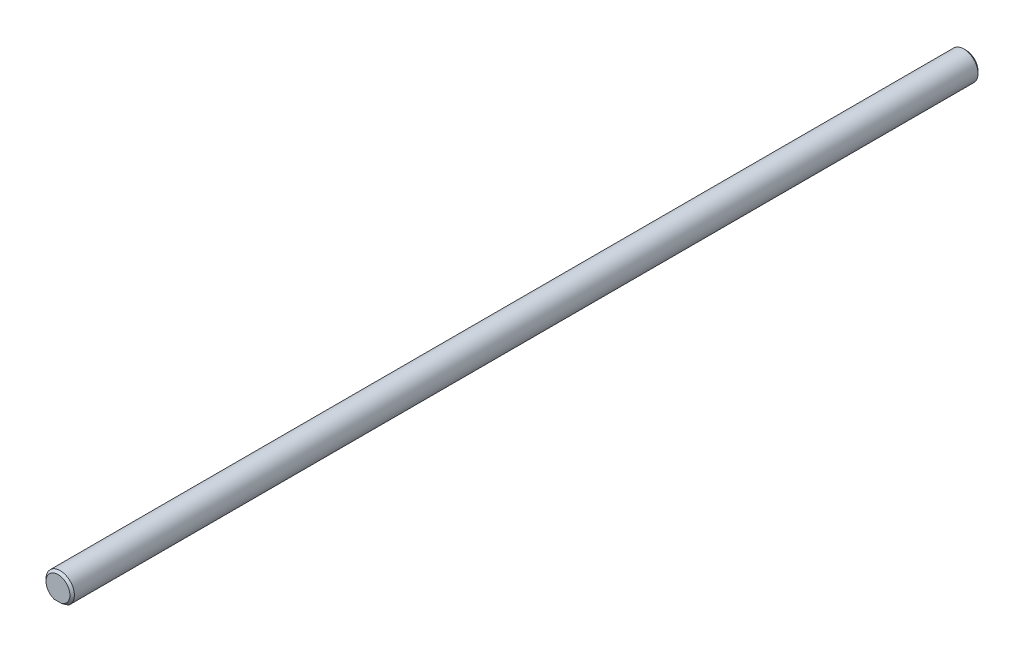
ISO-10303-21;
HEADER;
FILE_DESCRIPTION(('STEP AP214'),'2;1');
FILE_NAME('part.step','',(''),(''),'','','');
FILE_SCHEMA(('AUTOMOTIVE_DESIGN { 1 0 10303 214 1 1 1 1 }'));
ENDSEC;
DATA;
#1=APPLICATION_CONTEXT('core data for automotive mechanical design processes');
#2=APPLICATION_PROTOCOL_DEFINITION('international standard','automotive_design',2000,#1);
#3=PRODUCT_CONTEXT('',#1,'mechanical');
#4=PRODUCT('Part','Part','',(#3));
#5=PRODUCT_RELATED_PRODUCT_CATEGORY('part','',(#4));
#6=PRODUCT_DEFINITION_FORMATION('','',#4);
#7=PRODUCT_DEFINITION_CONTEXT('part definition',#1,'design');
#8=PRODUCT_DEFINITION('design','',#6,#7);
#9=PRODUCT_DEFINITION_SHAPE('','',#8);
#10=(LENGTH_UNIT() NAMED_UNIT(*) SI_UNIT(.MILLI.,.METRE.));
#11=(NAMED_UNIT(*) PLANE_ANGLE_UNIT() SI_UNIT($,.RADIAN.));
#12=(NAMED_UNIT(*) SI_UNIT($,.STERADIAN.) SOLID_ANGLE_UNIT());
#13=UNCERTAINTY_MEASURE_WITH_UNIT(LENGTH_MEASURE(1.E-05),#10,'distance_accuracy_value','');
#14=(GEOMETRIC_REPRESENTATION_CONTEXT(3) GLOBAL_UNCERTAINTY_ASSIGNED_CONTEXT((#13)) GLOBAL_UNIT_ASSIGNED_CONTEXT((#10,
#11,#12)) REPRESENTATION_CONTEXT('',''));
#15=CARTESIAN_POINT('',(0.,0.,0.));
#16=DIRECTION('',(0.,0.,1.));
#17=DIRECTION('',(1.,0.,0.));
#18=AXIS2_PLACEMENT_3D('',#15,#16,#17);
#19=CARTESIAN_POINT('',(0.,0.,-101.6));
#20=DIRECTION('',(0.,0.,-1.));
#21=DIRECTION('',(-1.,0.,0.));
#22=AXIS2_PLACEMENT_3D('',#19,#20,#21);
#23=PLANE('',#22);
#24=DIRECTION('',(1.,0.,0.));
#25=VECTOR('',#24,1.);
#26=CARTESIAN_POINT('',(-1.905,-2.54,-101.6));
#27=LINE('',#26,#25);
#28=CARTESIAN_POINT('',(-0.839061976256765,-2.54,-101.6));
#29=VERTEX_POINT('',#28);
#30=CARTESIAN_POINT('',(0.839061976256765,-2.54,-101.6));
#31=VERTEX_POINT('',#30);
#32=EDGE_CURVE('E101',#29,#31,#27,.T.);
#33=ORIENTED_EDGE('',*,*,#32,.F.);
#34=CARTESIAN_POINT('',(0.,0.,-101.6));
#35=DIRECTION('',(0.,0.,-1.));
#36=DIRECTION('',(-1.,0.,0.));
#37=AXIS2_PLACEMENT_3D('',#34,#35,#36);
#38=CIRCLE('',#37,2.67499999999998);
#39=EDGE_CURVE('E46',#29,#31,#38,.T.);
#40=ORIENTED_EDGE('',*,*,#39,.T.);
#41=EDGE_LOOP('',(#33,#40));
#42=FACE_BOUND('',#41,.T.);
#43=ADVANCED_FACE('F36',(#42),#23,.T.);
#44=CARTESIAN_POINT('',(0.,0.,101.6));
#45=DIRECTION('',(0.,0.,-1.));
#46=DIRECTION('',(-1.,0.,0.));
#47=AXIS2_PLACEMENT_3D('',#44,#45,#46);
#48=PLANE('',#47);
#49=DIRECTION('',(1.,0.,0.));
#50=VECTOR('',#49,1.);
#51=CARTESIAN_POINT('',(-1.905,-2.54,101.6));
#52=LINE('',#51,#50);
#53=CARTESIAN_POINT('',(-0.839061976256853,-2.54,101.6));
#54=VERTEX_POINT('',#53);
#55=CARTESIAN_POINT('',(0.839061976256853,-2.54,101.6));
#56=VERTEX_POINT('',#55);
#57=EDGE_CURVE('E97',#54,#56,#52,.T.);
#58=ORIENTED_EDGE('',*,*,#57,.T.);
#59=CARTESIAN_POINT('',(0.,0.,101.6));
#60=DIRECTION('',(0.,0.,-1.));
#61=DIRECTION('',(-1.,0.,0.));
#62=AXIS2_PLACEMENT_3D('',#59,#60,#61);
#63=CIRCLE('',#62,2.67500000000001);
#64=EDGE_CURVE('E11',#56,#54,#63,.F.);
#65=ORIENTED_EDGE('',*,*,#64,.T.);
#66=EDGE_LOOP('',(#58,#65));
#67=FACE_BOUND('',#66,.T.);
#68=ADVANCED_FACE('F121',(#67),#48,.F.);
#69=CARTESIAN_POINT('',(0.,0.,-101.6));
#70=DIRECTION('',(0.,0.,1.));
#71=DIRECTION('',(1.,0.,0.));
#72=AXIS2_PLACEMENT_3D('',#69,#70,#71);
#73=CYLINDRICAL_SURFACE('',#72,3.175);
#74=DIRECTION('',(0.,0.,1.));
#75=VECTOR('',#74,1.);
#76=CARTESIAN_POINT('',(1.905,-2.54,-101.6));
#77=LINE('',#76,#75);
#78=CARTESIAN_POINT('',(1.905,-2.54,-101.1));
#79=VERTEX_POINT('',#78);
#80=CARTESIAN_POINT('',(1.905,-2.54,101.1));
#81=VERTEX_POINT('',#80);
#82=EDGE_CURVE('E90',#79,#81,#77,.T.);
#83=ORIENTED_EDGE('',*,*,#82,.F.);
#84=CARTESIAN_POINT('',(0.,0.,-101.1));
#85=DIRECTION('',(0.,0.,-1.));
#86=DIRECTION('',(-1.,0.,0.));
#87=AXIS2_PLACEMENT_3D('',#84,#85,#86);
#88=CIRCLE('',#87,3.175);
#89=CARTESIAN_POINT('',(-1.905,-2.54,-101.1));
#90=VERTEX_POINT('',#89);
#91=EDGE_CURVE('E80',#79,#90,#88,.F.);
#92=ORIENTED_EDGE('',*,*,#91,.T.);
#93=DIRECTION('',(0.,0.,1.));
#94=VECTOR('',#93,1.);
#95=CARTESIAN_POINT('',(-1.905,-2.54,-101.6));
#96=LINE('',#95,#94);
#97=CARTESIAN_POINT('',(-1.905,-2.54,101.1));
#98=VERTEX_POINT('',#97);
#99=EDGE_CURVE('E87',#90,#98,#96,.T.);
#100=ORIENTED_EDGE('',*,*,#99,.T.);
#101=CARTESIAN_POINT('',(0.,0.,101.1));
#102=DIRECTION('',(0.,0.,-1.));
#103=DIRECTION('',(-1.,0.,0.));
#104=AXIS2_PLACEMENT_3D('',#101,#102,#103);
#105=CIRCLE('',#104,3.175);
#106=EDGE_CURVE('E92',#98,#81,#105,.T.);
#107=ORIENTED_EDGE('',*,*,#106,.T.);
#108=EDGE_LOOP('',(#83,#92,#100,#107));
#109=FACE_BOUND('',#108,.T.);
#110=ADVANCED_FACE('F86',(#109),#73,.T.);
#111=CARTESIAN_POINT('',(-1.905,-2.54,-101.6));
#112=DIRECTION('',(0.,-1.,0.));
#113=DIRECTION('',(0.,0.,-1.));
#114=AXIS2_PLACEMENT_3D('',#111,#112,#113);
#115=PLANE('',#114);
#116=ORIENTED_EDGE('',*,*,#99,.F.);
#117=CARTESIAN_POINT('',(-1.905,-2.54,-101.1));
#118=CARTESIAN_POINT('',(-1.82057616384331,-2.54,-101.150612079058));
#119=CARTESIAN_POINT('',(-1.73520085655566,-2.54,-101.199722808161));
#120=CARTESIAN_POINT('',(-1.56255506901464,-2.54,-101.293743980208));
#121=CARTESIAN_POINT('',(-1.4752920570291,-2.54,-101.338668195303));
#122=CARTESIAN_POINT('',(-1.29822184149407,-2.54,-101.423518801737));
#123=CARTESIAN_POINT('',(-1.20841230086507,-2.54,-101.463440407052));
#124=CARTESIAN_POINT('',(-1.02588565435885,-2.54,-101.536921088513));
#125=CARTESIAN_POINT('',(-0.933159615756485,-2.54,-101.570457824066));
#126=CARTESIAN_POINT('',(-0.839061976256764,-2.54,-101.6));
#127=B_SPLINE_CURVE_WITH_KNOTS('',3,(#117,#118,#119,#120,#121,#122,#123,#124,#125,#126),
.UNSPECIFIED.,.F.,.F.,(4,2,2,2,4),(0.,0.295344631156658,0.589680590550518,0.884296027084834,
1.17992410070191),.UNSPECIFIED.);
#128=EDGE_CURVE('E58',#90,#29,#127,.T.);
#129=ORIENTED_EDGE('',*,*,#128,.T.);
#130=ORIENTED_EDGE('',*,*,#32,.T.);
#131=CARTESIAN_POINT('',(0.839061976256765,-2.54,-101.6));
#132=CARTESIAN_POINT('',(0.933159615756486,-2.54,-101.570457824066));
#133=CARTESIAN_POINT('',(1.02588565435885,-2.54,-101.536921088513));
#134=CARTESIAN_POINT('',(1.20841230086507,-2.54,-101.463440407052));
#135=CARTESIAN_POINT('',(1.29822184149407,-2.54,-101.423518801737));
#136=CARTESIAN_POINT('',(1.47529205702911,-2.54,-101.338668195303));
#137=CARTESIAN_POINT('',(1.56255506901464,-2.54,-101.293743980208));
#138=CARTESIAN_POINT('',(1.73520085655566,-2.54,-101.199722808161));
#139=CARTESIAN_POINT('',(1.82057616384331,-2.54,-101.150612079058));
#140=CARTESIAN_POINT('',(1.905,-2.54,-101.1));
#141=B_SPLINE_CURVE_WITH_KNOTS('',3,(#131,#132,#133,#134,#135,#136,#137,#138,#139,#140),
.UNSPECIFIED.,.F.,.F.,(4,2,2,2,4),(0.,0.295628073617077,0.590243510151393,0.884579469545252,
1.17992410070191),.UNSPECIFIED.);
#142=EDGE_CURVE('E81',#31,#79,#141,.T.);
#143=ORIENTED_EDGE('',*,*,#142,.T.);
#144=ORIENTED_EDGE('',*,*,#82,.T.);
#145=CARTESIAN_POINT('',(1.905,-2.54,101.1));
#146=CARTESIAN_POINT('',(1.82057616384332,-2.54,101.150612079058));
#147=CARTESIAN_POINT('',(1.73520085655567,-2.54,101.199722808161));
#148=CARTESIAN_POINT('',(1.56255506901467,-2.54,101.293743980208));
#149=CARTESIAN_POINT('',(1.47529205702914,-2.54,101.338668195303));
#150=CARTESIAN_POINT('',(1.29822184149411,-2.54,101.423518801737));
#151=CARTESIAN_POINT('',(1.20841230086513,-2.54,101.463440407052));
#152=CARTESIAN_POINT('',(1.02588565435892,-2.54,101.536921088513));
#153=CARTESIAN_POINT('',(0.933159615756568,-2.54,101.570457824066));
#154=CARTESIAN_POINT('',(0.83906197625685,-2.54,101.6));
#155=B_SPLINE_CURVE_WITH_KNOTS('',3,(#145,#146,#147,#148,#149,#150,#151,#152,#153,#154),
.UNSPECIFIED.,.F.,.F.,(4,2,2,2,4),(0.,0.295344631156642,0.589680590550466,0.884296027084773,
1.17992410070182),.UNSPECIFIED.);
#156=EDGE_CURVE('E91',#81,#56,#155,.T.);
#157=ORIENTED_EDGE('',*,*,#156,.T.);
#158=ORIENTED_EDGE('',*,*,#57,.F.);
#159=CARTESIAN_POINT('',(-0.839061976256853,-2.54,101.6));
#160=CARTESIAN_POINT('',(-0.933159615756569,-2.54,101.570457824066));
#161=CARTESIAN_POINT('',(-1.02588565435892,-2.54,101.536921088513));
#162=CARTESIAN_POINT('',(-1.20841230086513,-2.54,101.463440407052));
#163=CARTESIAN_POINT('',(-1.29822184149412,-2.54,101.423518801737));
#164=CARTESIAN_POINT('',(-1.47529205702914,-2.54,101.338668195303));
#165=CARTESIAN_POINT('',(-1.56255506901467,-2.54,101.293743980208));
#166=CARTESIAN_POINT('',(-1.73520085655567,-2.54,101.199722808161));
#167=CARTESIAN_POINT('',(-1.82057616384332,-2.54,101.150612079058));
#168=CARTESIAN_POINT('',(-1.905,-2.54,101.1));
#169=B_SPLINE_CURVE_WITH_KNOTS('',3,(#159,#160,#161,#162,#163,#164,#165,#166,#167,#168),
.UNSPECIFIED.,.F.,.F.,(4,2,2,2,4),(0.,0.295628073617056,0.590243510151351,0.884579469545175,
1.17992410070182),.UNSPECIFIED.);
#170=EDGE_CURVE('E96',#54,#98,#169,.T.);
#171=ORIENTED_EDGE('',*,*,#170,.T.);
#172=EDGE_LOOP('',(#116,#129,#130,#143,#144,#157,#158,#171));
#173=FACE_BOUND('',#172,.T.);
#174=ADVANCED_FACE('F94',(#173),#115,.T.);
#175=CARTESIAN_POINT('',(0.,0.,-101.1));
#176=DIRECTION('',(0.,0.,1.));
#177=DIRECTION('',(1.,0.,0.));
#178=AXIS2_PLACEMENT_3D('',#175,#176,#177);
#179=CONICAL_SURFACE('',#178,3.175,0.785398163397465);
#180=ORIENTED_EDGE('',*,*,#142,.F.);
#181=ORIENTED_EDGE('',*,*,#39,.F.);
#182=ORIENTED_EDGE('',*,*,#128,.F.);
#183=ORIENTED_EDGE('',*,*,#91,.F.);
#184=EDGE_LOOP('',(#180,#181,#182,#183));
#185=FACE_BOUND('',#184,.T.);
#186=ADVANCED_FACE('F79',(#185),#179,.T.);
#187=CARTESIAN_POINT('',(0.,0.,101.6));
#188=DIRECTION('',(0.,0.,-1.));
#189=DIRECTION('',(-1.,0.,0.));
#190=AXIS2_PLACEMENT_3D('',#187,#188,#189);
#191=CONICAL_SURFACE('',#190,2.67500000000001,0.785398163397465);
#192=ORIENTED_EDGE('',*,*,#156,.F.);
#193=ORIENTED_EDGE('',*,*,#106,.F.);
#194=ORIENTED_EDGE('',*,*,#170,.F.);
#195=ORIENTED_EDGE('',*,*,#64,.F.);
#196=EDGE_LOOP('',(#192,#193,#194,#195));
#197=FACE_BOUND('',#196,.T.);
#198=ADVANCED_FACE('F39',(#197),#191,.T.);
#199=CLOSED_SHELL('',(#43,#68,#110,#174,#186,#198));
#200=MANIFOLD_SOLID_BREP('B2',#199);
#201=ADVANCED_BREP_SHAPE_REPRESENTATION('',(#18,#200),#14);
#202=SHAPE_DEFINITION_REPRESENTATION(#9,#201);
ENDSEC;
END-ISO-10303-21;
